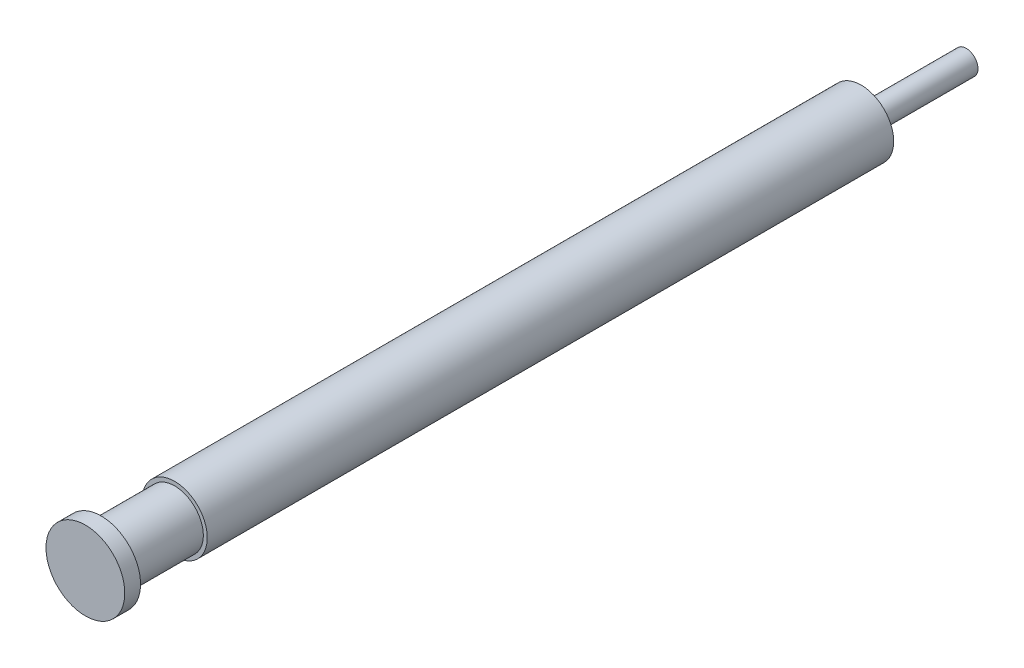
ISO-10303-21;
HEADER;
FILE_DESCRIPTION(('STEP AP214'),'2;1');
FILE_NAME('part.step','',(''),(''),'','','');
FILE_SCHEMA(('AUTOMOTIVE_DESIGN { 1 0 10303 214 1 1 1 1 }'));
ENDSEC;
DATA;
#1=APPLICATION_CONTEXT('core data for automotive mechanical design processes');
#2=APPLICATION_PROTOCOL_DEFINITION('international standard','automotive_design',2000,#1);
#3=PRODUCT_CONTEXT('',#1,'mechanical');
#4=PRODUCT('Part','Part','',(#3));
#5=PRODUCT_RELATED_PRODUCT_CATEGORY('part','',(#4));
#6=PRODUCT_DEFINITION_FORMATION('','',#4);
#7=PRODUCT_DEFINITION_CONTEXT('part definition',#1,'design');
#8=PRODUCT_DEFINITION('design','',#6,#7);
#9=PRODUCT_DEFINITION_SHAPE('','',#8);
#10=(LENGTH_UNIT() NAMED_UNIT(*) SI_UNIT(.MILLI.,.METRE.));
#11=(NAMED_UNIT(*) PLANE_ANGLE_UNIT() SI_UNIT($,.RADIAN.));
#12=(NAMED_UNIT(*) SI_UNIT($,.STERADIAN.) SOLID_ANGLE_UNIT());
#13=UNCERTAINTY_MEASURE_WITH_UNIT(LENGTH_MEASURE(1.E-05),#10,'distance_accuracy_value','');
#14=(GEOMETRIC_REPRESENTATION_CONTEXT(3) GLOBAL_UNCERTAINTY_ASSIGNED_CONTEXT((#13)) GLOBAL_UNIT_ASSIGNED_CONTEXT((#10,
#11,#12)) REPRESENTATION_CONTEXT('',''));
#15=CARTESIAN_POINT('',(0.,0.,0.));
#16=DIRECTION('',(0.,0.,1.));
#17=DIRECTION('',(1.,0.,0.));
#18=AXIS2_PLACEMENT_3D('',#15,#16,#17);
#19=CARTESIAN_POINT('',(25.9932499833334,0.,-27.8475545000964));
#20=DIRECTION('',(0.,0.,1.));
#21=DIRECTION('',(1.,0.,0.));
#22=AXIS2_PLACEMENT_3D('',#19,#20,#21);
#23=PLANE('',#22);
#24=CARTESIAN_POINT('',(24.8682499833334,0.,-27.8475545000964));
#25=DIRECTION('',(0.,0.,-1.));
#26=DIRECTION('',(-1.,0.,0.));
#27=AXIS2_PLACEMENT_3D('',#24,#25,#26);
#28=CIRCLE('',#27,1.12500000000001);
#29=CARTESIAN_POINT('',(23.7432499833334,0.,-27.8475545000964));
#30=VERTEX_POINT('',#29);
#31=EDGE_CURVE('E10',#30,#30,#28,.T.);
#32=ORIENTED_EDGE('',*,*,#31,.T.);
#33=EDGE_LOOP('',(#32));
#34=FACE_BOUND('',#33,.T.);
#35=ADVANCED_FACE('F33',(#34),#23,.F.);
#36=CARTESIAN_POINT('',(24.8682499833334,0.,-17.0056108200556));
#37=DIRECTION('',(0.,0.,-1.));
#38=DIRECTION('',(-1.,0.,0.));
#39=AXIS2_PLACEMENT_3D('',#36,#37,#38);
#40=CYLINDRICAL_SURFACE('',#39,1.125);
#41=ORIENTED_EDGE('',*,*,#31,.F.);
#42=EDGE_LOOP('',(#41));
#43=FACE_BOUND('',#42,.T.);
#44=CARTESIAN_POINT('',(24.8682499833334,0.,-17.8475545000964));
#45=DIRECTION('',(0.,0.,-1.));
#46=DIRECTION('',(-1.,0.,0.));
#47=AXIS2_PLACEMENT_3D('',#44,#45,#46);
#48=CIRCLE('',#47,1.125);
#49=CARTESIAN_POINT('',(23.7432499833334,0.,-17.8475545000964));
#50=VERTEX_POINT('',#49);
#51=EDGE_CURVE('E39',#50,#50,#48,.T.);
#52=ORIENTED_EDGE('',*,*,#51,.T.);
#53=EDGE_LOOP('',(#52));
#54=FACE_BOUND('',#53,.T.);
#55=ADVANCED_FACE('F77',(#43,#54),#40,.T.);
#56=CARTESIAN_POINT('',(25.9932499833334,0.,-17.8475545000964));
#57=DIRECTION('',(0.,0.,1.));
#58=DIRECTION('',(1.,0.,0.));
#59=AXIS2_PLACEMENT_3D('',#56,#57,#58);
#60=PLANE('',#59);
#61=ORIENTED_EDGE('',*,*,#51,.F.);
#62=EDGE_LOOP('',(#61));
#63=FACE_BOUND('',#62,.T.);
#64=CARTESIAN_POINT('',(24.8682499833334,0.,-17.8475545000964));
#65=DIRECTION('',(0.,0.,-1.));
#66=DIRECTION('',(-1.,0.,0.));
#67=AXIS2_PLACEMENT_3D('',#64,#65,#66);
#68=CIRCLE('',#67,3.1);
#69=CARTESIAN_POINT('',(21.7682499833334,0.,-17.8475545000964));
#70=VERTEX_POINT('',#69);
#71=EDGE_CURVE('E43',#70,#70,#68,.T.);
#72=ORIENTED_EDGE('',*,*,#71,.T.);
#73=EDGE_LOOP('',(#72));
#74=FACE_BOUND('',#73,.T.);
#75=ADVANCED_FACE('F81',(#63,#74),#60,.F.);
#76=CARTESIAN_POINT('',(24.8682499833334,0.,-17.0056108200556));
#77=DIRECTION('',(0.,0.,-1.));
#78=DIRECTION('',(-1.,0.,0.));
#79=AXIS2_PLACEMENT_3D('',#76,#77,#78);
#80=CYLINDRICAL_SURFACE('',#79,3.1);
#81=ORIENTED_EDGE('',*,*,#71,.F.);
#82=EDGE_LOOP('',(#81));
#83=FACE_BOUND('',#82,.T.);
#84=CARTESIAN_POINT('',(24.8682499833335,0.,47.4943891799444));
#85=DIRECTION('',(0.,0.,-1.));
#86=DIRECTION('',(-1.,0.,0.));
#87=AXIS2_PLACEMENT_3D('',#84,#85,#86);
#88=CIRCLE('',#87,3.1);
#89=CARTESIAN_POINT('',(21.7682499833335,0.,47.4943891799444));
#90=VERTEX_POINT('',#89);
#91=EDGE_CURVE('E47',#90,#90,#88,.T.);
#92=ORIENTED_EDGE('',*,*,#91,.T.);
#93=EDGE_LOOP('',(#92));
#94=FACE_BOUND('',#93,.T.);
#95=ADVANCED_FACE('F86',(#83,#94),#80,.T.);
#96=CARTESIAN_POINT('',(27.5932499833334,0.,47.4943891799444));
#97=DIRECTION('',(0.,0.,-1.));
#98=DIRECTION('',(-1.,0.,0.));
#99=AXIS2_PLACEMENT_3D('',#96,#97,#98);
#100=PLANE('',#99);
#101=ORIENTED_EDGE('',*,*,#91,.F.);
#102=EDGE_LOOP('',(#101));
#103=FACE_BOUND('',#102,.T.);
#104=CARTESIAN_POINT('',(24.8682499833335,0.,47.4943891799444));
#105=DIRECTION('',(0.,0.,-1.));
#106=DIRECTION('',(-1.,0.,0.));
#107=AXIS2_PLACEMENT_3D('',#104,#105,#106);
#108=CIRCLE('',#107,2.72499999999999);
#109=CARTESIAN_POINT('',(22.1432499833335,0.,47.4943891799444));
#110=VERTEX_POINT('',#109);
#111=EDGE_CURVE('E52',#110,#110,#108,.T.);
#112=ORIENTED_EDGE('',*,*,#111,.T.);
#113=EDGE_LOOP('',(#112));
#114=FACE_BOUND('',#113,.T.);
#115=ADVANCED_FACE('F92',(#103,#114),#100,.F.);
#116=CARTESIAN_POINT('',(24.8682499833334,0.,-17.0056108200556));
#117=DIRECTION('',(0.,0.,-1.));
#118=DIRECTION('',(-1.,0.,0.));
#119=AXIS2_PLACEMENT_3D('',#116,#117,#118);
#120=CYLINDRICAL_SURFACE('',#119,2.72499999999999);
#121=ORIENTED_EDGE('',*,*,#111,.F.);
#122=EDGE_LOOP('',(#121));
#123=FACE_BOUND('',#122,.T.);
#124=CARTESIAN_POINT('',(24.8682499833335,0.,54.4943891799444));
#125=DIRECTION('',(0.,0.,-1.));
#126=DIRECTION('',(-1.,0.,0.));
#127=AXIS2_PLACEMENT_3D('',#124,#125,#126);
#128=CIRCLE('',#127,2.72499999999999);
#129=CARTESIAN_POINT('',(22.1432499833335,0.,54.4943891799444));
#130=VERTEX_POINT('',#129);
#131=EDGE_CURVE('E55',#130,#130,#128,.T.);
#132=ORIENTED_EDGE('',*,*,#131,.T.);
#133=EDGE_LOOP('',(#132));
#134=FACE_BOUND('',#133,.T.);
#135=ADVANCED_FACE('F96',(#123,#134),#120,.T.);
#136=CARTESIAN_POINT('',(27.5932499833335,0.,54.4943891799444));
#137=DIRECTION('',(0.,0.,1.));
#138=DIRECTION('',(1.,0.,0.));
#139=AXIS2_PLACEMENT_3D('',#136,#137,#138);
#140=PLANE('',#139);
#141=ORIENTED_EDGE('',*,*,#131,.F.);
#142=EDGE_LOOP('',(#141));
#143=FACE_BOUND('',#142,.T.);
#144=CARTESIAN_POINT('',(24.8682499833335,0.,54.4943891799444));
#145=DIRECTION('',(0.,0.,-1.));
#146=DIRECTION('',(-1.,0.,0.));
#147=AXIS2_PLACEMENT_3D('',#144,#145,#146);
#148=CIRCLE('',#147,3.75);
#149=CARTESIAN_POINT('',(21.1182499833335,0.,54.4943891799444));
#150=VERTEX_POINT('',#149);
#151=EDGE_CURVE('E58',#150,#150,#148,.T.);
#152=ORIENTED_EDGE('',*,*,#151,.T.);
#153=EDGE_LOOP('',(#152));
#154=FACE_BOUND('',#153,.T.);
#155=ADVANCED_FACE('F73',(#143,#154),#140,.F.);
#156=CARTESIAN_POINT('',(24.8682499833334,0.,-17.0056108200556));
#157=DIRECTION('',(0.,0.,-1.));
#158=DIRECTION('',(-1.,0.,0.));
#159=AXIS2_PLACEMENT_3D('',#156,#157,#158);
#160=CYLINDRICAL_SURFACE('',#159,3.75);
#161=ORIENTED_EDGE('',*,*,#151,.F.);
#162=EDGE_LOOP('',(#161));
#163=FACE_BOUND('',#162,.T.);
#164=CARTESIAN_POINT('',(24.8682499833335,0.,55.9943891799444));
#165=DIRECTION('',(0.,0.,-1.));
#166=DIRECTION('',(-1.,0.,0.));
#167=AXIS2_PLACEMENT_3D('',#164,#165,#166);
#168=CIRCLE('',#167,3.75);
#169=CARTESIAN_POINT('',(21.1182499833335,0.,55.9943891799444));
#170=VERTEX_POINT('',#169);
#171=EDGE_CURVE('E61',#170,#170,#168,.T.);
#172=ORIENTED_EDGE('',*,*,#171,.T.);
#173=EDGE_LOOP('',(#172));
#174=FACE_BOUND('',#173,.T.);
#175=ADVANCED_FACE('F65',(#163,#174),#160,.T.);
#176=CARTESIAN_POINT('',(28.6182499833335,0.,55.9943891799444));
#177=DIRECTION('',(0.,0.,-1.));
#178=DIRECTION('',(-1.,0.,0.));
#179=AXIS2_PLACEMENT_3D('',#176,#177,#178);
#180=PLANE('',#179);
#181=ORIENTED_EDGE('',*,*,#171,.F.);
#182=EDGE_LOOP('',(#181));
#183=FACE_BOUND('',#182,.T.);
#184=ADVANCED_FACE('F67',(#183),#180,.F.);
#185=CLOSED_SHELL('',(#35,#55,#75,#95,#115,#135,#155,#175,#184));
#186=MANIFOLD_SOLID_BREP('B2',#185);
#187=ADVANCED_BREP_SHAPE_REPRESENTATION('',(#18,#186),#14);
#188=SHAPE_DEFINITION_REPRESENTATION(#9,#187);
ENDSEC;
END-ISO-10303-21;
